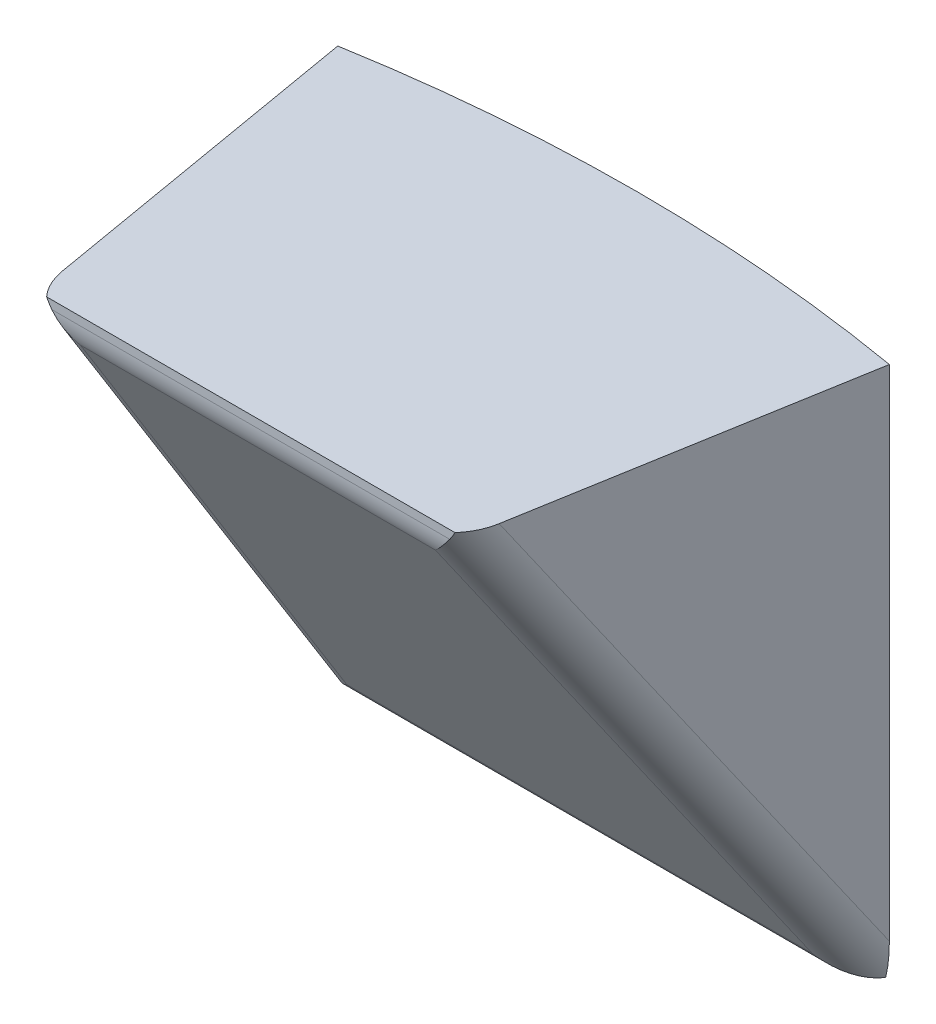
ISO-10303-21;
HEADER;
FILE_DESCRIPTION(('STEP AP214'),'2;1');
FILE_NAME('part.step','',(''),(''),'','','');
FILE_SCHEMA(('AUTOMOTIVE_DESIGN { 1 0 10303 214 1 1 1 1 }'));
ENDSEC;
DATA;
#1=APPLICATION_CONTEXT('core data for automotive mechanical design processes');
#2=APPLICATION_PROTOCOL_DEFINITION('international standard','automotive_design',2000,#1);
#3=PRODUCT_CONTEXT('',#1,'mechanical');
#4=PRODUCT('Part','Part','',(#3));
#5=PRODUCT_RELATED_PRODUCT_CATEGORY('part','',(#4));
#6=PRODUCT_DEFINITION_FORMATION('','',#4);
#7=PRODUCT_DEFINITION_CONTEXT('part definition',#1,'design');
#8=PRODUCT_DEFINITION('design','',#6,#7);
#9=PRODUCT_DEFINITION_SHAPE('','',#8);
#10=(LENGTH_UNIT() NAMED_UNIT(*) SI_UNIT(.MILLI.,.METRE.));
#11=(NAMED_UNIT(*) PLANE_ANGLE_UNIT() SI_UNIT($,.RADIAN.));
#12=(NAMED_UNIT(*) SI_UNIT($,.STERADIAN.) SOLID_ANGLE_UNIT());
#13=UNCERTAINTY_MEASURE_WITH_UNIT(LENGTH_MEASURE(1.E-05),#10,'distance_accuracy_value','');
#14=(GEOMETRIC_REPRESENTATION_CONTEXT(3) GLOBAL_UNCERTAINTY_ASSIGNED_CONTEXT((#13)) GLOBAL_UNIT_ASSIGNED_CONTEXT((#10,
#11,#12)) REPRESENTATION_CONTEXT('',''));
#15=CARTESIAN_POINT('',(0.,0.,0.));
#16=DIRECTION('',(0.,0.,1.));
#17=DIRECTION('',(1.,0.,0.));
#18=AXIS2_PLACEMENT_3D('',#15,#16,#17);
#19=CARTESIAN_POINT('',(-12.7,31.75,-73.8463201327698));
#20=DIRECTION('',(0.985526486983062,0.,-0.16952151325075));
#21=DIRECTION('',(-0.16952151325075,0.,-0.985526486983062));
#22=AXIS2_PLACEMENT_3D('',#19,#20,#21);
#23=PLANE('',#22);
#24=DIRECTION('',(0.,-1.,0.));
#25=VECTOR('',#24,1.);
#26=CARTESIAN_POINT('',(-16.4137200465182,31.75,-95.4363201327698));
#27=LINE('',#26,#25);
#28=CARTESIAN_POINT('',(-16.4137200465182,31.75,-95.4363201327698));
#29=VERTEX_POINT('',#28);
#30=CARTESIAN_POINT('',(-16.4137200465182,2.02817315435391,-95.4363201327698));
#31=VERTEX_POINT('',#30);
#32=EDGE_CURVE('E134',#29,#31,#27,.T.);
#33=ORIENTED_EDGE('',*,*,#32,.T.);
#34=DIRECTION('',(0.0949832196734159,0.828288489868125,0.55219232657875));
#35=VECTOR('',#34,1.);
#36=CARTESIAN_POINT('',(-12.9095211733622,32.5860717265832,-75.0643877512836));
#37=LINE('',#36,#35);
#38=CARTESIAN_POINT('',(-13.0053969285371,31.75,-75.6217689023391));
#39=VERTEX_POINT('',#38);
#40=EDGE_CURVE('E50',#31,#39,#37,.T.);
#41=ORIENTED_EDGE('',*,*,#40,.T.);
#42=DIRECTION('',(0.16952151325075,0.,0.985526486983062));
#43=VECTOR('',#42,1.);
#44=CARTESIAN_POINT('',(-12.7,31.75,-73.8463201327698));
#45=LINE('',#44,#43);
#46=EDGE_CURVE('E146',#29,#39,#45,.T.);
#47=ORIENTED_EDGE('',*,*,#46,.F.);
#48=EDGE_LOOP('',(#33,#41,#47));
#49=FACE_BOUND('',#48,.T.);
#50=ADVANCED_FACE('F39',(#49),#23,.F.);
#51=CARTESIAN_POINT('',(-12.7,31.75,-73.8463201327698));
#52=DIRECTION('',(0.,0.,-1.));
#53=DIRECTION('',(-1.,0.,0.));
#54=AXIS2_PLACEMENT_3D('',#51,#52,#53);
#55=PLANE('',#54);
#56=DIRECTION('',(1.,0.,0.));
#57=VECTOR('',#56,1.);
#58=CARTESIAN_POINT('',(-12.7,31.2490501198393,-73.8463201327698));
#59=LINE('',#58,#57);
#60=CARTESIAN_POINT('',(-11.8405097304884,31.2490501198393,-73.8463201327698));
#61=VERTEX_POINT('',#60);
#62=CARTESIAN_POINT('',(11.8405097304884,31.2490501198393,-73.8463201327698));
#63=VERTEX_POINT('',#62);
#64=EDGE_CURVE('E65',#61,#63,#59,.T.);
#65=ORIENTED_EDGE('',*,*,#64,.T.);
#66=CARTESIAN_POINT('',(10.1226973769365,35.0590501198393,-73.8463201327698));
#67=DIRECTION('',(0.,0.,-1.));
#68=DIRECTION('',(0.113927444341676,-0.993489072625248,0.));
#69=AXIS2_PLACEMENT_3D('',#66,#67,#68);
#70=ELLIPSE('',#69,4.59984660731746,2.54);
#71=CARTESIAN_POINT('',(12.1490599067134,31.75,-73.8463201327698));
#72=VERTEX_POINT('',#71);
#73=EDGE_CURVE('E210',#63,#72,#70,.F.);
#74=ORIENTED_EDGE('',*,*,#73,.T.);
#75=DIRECTION('',(1.,0.,0.));
#76=VECTOR('',#75,1.);
#77=CARTESIAN_POINT('',(-12.7,31.75,-73.8463201327698));
#78=LINE('',#77,#76);
#79=CARTESIAN_POINT('',(-12.1490599067134,31.75,-73.8463201327698));
#80=VERTEX_POINT('',#79);
#81=EDGE_CURVE('E126',#80,#72,#78,.T.);
#82=ORIENTED_EDGE('',*,*,#81,.F.);
#83=CARTESIAN_POINT('',(-10.1226973769365,35.0590501198393,-73.8463201327698));
#84=DIRECTION('',(0.,0.,-1.));
#85=DIRECTION('',(0.113927444341676,0.993489072625247,0.));
#86=AXIS2_PLACEMENT_3D('',#83,#84,#85);
#87=ELLIPSE('',#86,4.59984660731746,2.54);
#88=EDGE_CURVE('E207',#80,#61,#87,.F.);
#89=ORIENTED_EDGE('',*,*,#88,.T.);
#90=EDGE_LOOP('',(#65,#74,#82,#89));
#91=FACE_BOUND('',#90,.T.);
#92=ADVANCED_FACE('F262',(#91),#55,.F.);
#93=CARTESIAN_POINT('',(12.7,31.75,-73.8463201327698));
#94=DIRECTION('',(-0.985526486983062,0.,-0.169521513250749));
#95=DIRECTION('',(-0.169521513250749,0.,0.985526486983062));
#96=AXIS2_PLACEMENT_3D('',#93,#94,#95);
#97=PLANE('',#96);
#98=DIRECTION('',(0.169521513250749,0.,-0.985526486983062));
#99=VECTOR('',#98,1.);
#100=CARTESIAN_POINT('',(12.7,31.75,-73.8463201327698));
#101=LINE('',#100,#99);
#102=CARTESIAN_POINT('',(13.0053969285371,31.75,-75.6217689023391));
#103=VERTEX_POINT('',#102);
#104=CARTESIAN_POINT('',(16.4137200465182,31.75,-95.4363201327698));
#105=VERTEX_POINT('',#104);
#106=EDGE_CURVE('E113',#103,#105,#101,.T.);
#107=ORIENTED_EDGE('',*,*,#106,.F.);
#108=DIRECTION('',(0.0949832196734155,-0.828288489868125,-0.55219232657875));
#109=VECTOR('',#108,1.);
#110=CARTESIAN_POINT('',(12.9095211733622,32.5860717265832,-75.0643877512836));
#111=LINE('',#110,#109);
#112=CARTESIAN_POINT('',(16.4137200465182,2.02817315435392,-95.4363201327698));
#113=VERTEX_POINT('',#112);
#114=EDGE_CURVE('E131',#103,#113,#111,.T.);
#115=ORIENTED_EDGE('',*,*,#114,.T.);
#116=DIRECTION('',(0.,-1.,0.));
#117=VECTOR('',#116,1.);
#118=CARTESIAN_POINT('',(16.4137200465182,31.75,-95.4363201327698));
#119=LINE('',#118,#117);
#120=EDGE_CURVE('E129',#105,#113,#119,.T.);
#121=ORIENTED_EDGE('',*,*,#120,.F.);
#122=EDGE_LOOP('',(#107,#115,#121));
#123=FACE_BOUND('',#122,.T.);
#124=ADVANCED_FACE('F130',(#123),#97,.F.);
#125=CARTESIAN_POINT('',(0.,31.75,0.));
#126=DIRECTION('',(0.,-1.,0.));
#127=DIRECTION('',(0.,0.,-1.));
#128=AXIS2_PLACEMENT_3D('',#125,#126,#127);
#129=CYLINDRICAL_SURFACE('',#128,96.8375);
#130=CARTESIAN_POINT('',(-15.8853565424994,0.,-95.5256868793293));
#131=CARTESIAN_POINT('',(-15.9293247019239,-5.30976486019576E-07,-95.518375234398));
#132=CARTESIAN_POINT('',(-15.9732877254308,3.13031430708792E-05,-95.5110332481291));
#133=CARTESIAN_POINT('',(-16.061203500609,0.000159701574270502,-95.4962885929165));
#134=CARTESIAN_POINT('',(-16.1051562522804,0.000256265885913214,-95.4888859239726));
#135=CARTESIAN_POINT('',(-16.149103868034,0.000385195293598833,-95.4814529136913));
#136=B_SPLINE_CURVE_WITH_KNOTS('',3,(#130,#131,#132,#133,#134,#135),.UNSPECIFIED.,.F.,.F.,(4,2,
4),(0.,0.133715664395814,0.267431328791604),.UNSPECIFIED.);
#137=CARTESIAN_POINT('',(-15.8853565424994,0.,-95.5256868793293));
#138=VERTEX_POINT('',#137);
#139=CARTESIAN_POINT('',(-16.149103868034,0.000385195293598833,-95.4814529136913));
#140=VERTEX_POINT('',#139);
#141=EDGE_CURVE('E179',#138,#140,#136,.T.);
#142=ORIENTED_EDGE('',*,*,#141,.T.);
#143=CARTESIAN_POINT('',(-16.149103868034,0.000385195293596172,-95.4814529136911));
#144=CARTESIAN_POINT('',(-16.171933976302,0.0829069312364557,-95.4775913959373));
#145=CARTESIAN_POINT('',(-16.1931478382836,0.165875060018588,-95.4739952018541));
#146=CARTESIAN_POINT('',(-16.2324701708106,0.332552989709144,-95.4673175665721));
#147=CARTESIAN_POINT('',(-16.2505790849718,0.416262682867112,-95.4642360518408));
#148=CARTESIAN_POINT('',(-16.3002929933888,0.667529302727803,-95.4557645792868));
#149=CARTESIAN_POINT('',(-16.3274955551877,0.835996152764147,-95.4511120007597));
#150=CARTESIAN_POINT('',(-16.3707857121779,1.17435236915795,-95.4436968002256));
#151=CARTESIAN_POINT('',(-16.3868747310715,1.34424155048418,-95.4409339361369));
#152=CARTESIAN_POINT('',(-16.4029797826186,1.59996300795439,-95.4381668180346));
#153=CARTESIAN_POINT('',(-16.4070100021143,1.68555274984234,-95.4374739803222));
#154=CARTESIAN_POINT('',(-16.412378941859,1.85681767610045,-95.436550796089));
#155=CARTESIAN_POINT('',(-16.4137177103842,1.94249285891049,-95.4363204412726));
#156=CARTESIAN_POINT('',(-16.4137200465182,2.02817315435391,-95.4363201327698));
#157=B_SPLINE_CURVE_WITH_KNOTS('',3,(#143,#144,#145,#146,#147,#148,#149,#150,#151,#152,#153,
#154,#155,#156),.UNSPECIFIED.,.F.,.F.,(4,2,2,2,2,2,4),(0.,0.257087233597104,0.514137705491005,
1.02584055142907,1.53747783342796,1.79450207629623,2.05152170891185),.UNSPECIFIED.);
#158=EDGE_CURVE('E185',#140,#31,#157,.T.);
#159=ORIENTED_EDGE('',*,*,#158,.T.);
#160=ORIENTED_EDGE('',*,*,#32,.F.);
#161=CARTESIAN_POINT('',(0.,31.75,0.));
#162=DIRECTION('',(0.,1.,0.));
#163=DIRECTION('',(0.,0.,1.));
#164=AXIS2_PLACEMENT_3D('',#161,#162,#163);
#165=CIRCLE('',#164,96.8375);
#166=EDGE_CURVE('E118',#105,#29,#165,.T.);
#167=ORIENTED_EDGE('',*,*,#166,.F.);
#168=ORIENTED_EDGE('',*,*,#120,.T.);
#169=CARTESIAN_POINT('',(16.4137200465182,2.02817315435392,-95.4363201327698));
#170=CARTESIAN_POINT('',(16.4137177103842,1.9424928589105,-95.4363204412726));
#171=CARTESIAN_POINT('',(16.412378941859,1.85681767610046,-95.436550796089));
#172=CARTESIAN_POINT('',(16.4070100021143,1.68555274984235,-95.4374739803222));
#173=CARTESIAN_POINT('',(16.4029797826186,1.5999630079544,-95.4381668180346));
#174=CARTESIAN_POINT('',(16.3868747310715,1.3442415504842,-95.4409339361369));
#175=CARTESIAN_POINT('',(16.3707857121779,1.17435236915796,-95.4436968002256));
#176=CARTESIAN_POINT('',(16.3274955551877,0.835996152764155,-95.4511120007597));
#177=CARTESIAN_POINT('',(16.3002929933888,0.66752930272781,-95.4557645792868));
#178=CARTESIAN_POINT('',(16.2505790849718,0.416262682867121,-95.4642360518408));
#179=CARTESIAN_POINT('',(16.2324701708106,0.332552989709155,-95.4673175665721));
#180=CARTESIAN_POINT('',(16.1931478382836,0.165875060018597,-95.4739952018541));
#181=CARTESIAN_POINT('',(16.171933976302,0.0829069312364613,-95.4775913959374));
#182=CARTESIAN_POINT('',(16.1491038680341,0.00038519529359121,-95.4814529136913));
#183=B_SPLINE_CURVE_WITH_KNOTS('',3,(#169,#170,#171,#172,#173,#174,#175,#176,#177,#178,#179,
#180,#181,#182),.UNSPECIFIED.,.F.,.F.,(4,2,2,2,2,2,4),(0.,0.257019632615621,0.514043875483893,
1.02568115748278,1.53738400342085,1.79443447531475,2.05152170891185),.UNSPECIFIED.);
#184=CARTESIAN_POINT('',(16.1491038680342,0.000385195293591076,-95.4814529136915));
#185=VERTEX_POINT('',#184);
#186=EDGE_CURVE('E159',#113,#185,#183,.T.);
#187=ORIENTED_EDGE('',*,*,#186,.T.);
#188=CARTESIAN_POINT('',(16.1491038680342,0.000385195293591076,-95.4814529136915));
#189=CARTESIAN_POINT('',(16.1051562522805,0.000256265885909297,-95.4888859239727));
#190=CARTESIAN_POINT('',(16.0612035006091,0.000159701574269132,-95.4962885929165));
#191=CARTESIAN_POINT('',(15.9732877254308,3.13031430720236E-05,-95.5110332481291));
#192=CARTESIAN_POINT('',(15.9293247019239,-5.3097648490922E-07,-95.5183752343979));
#193=CARTESIAN_POINT('',(15.8853565424994,0.,-95.5256868793293));
#194=B_SPLINE_CURVE_WITH_KNOTS('',3,(#188,#189,#190,#191,#192,#193),.UNSPECIFIED.,.F.,.F.,(4,2,
4),(0.,0.133715664395864,0.267431328791752),.UNSPECIFIED.);
#195=CARTESIAN_POINT('',(15.8853565424994,0.,-95.5256868793293));
#196=VERTEX_POINT('',#195);
#197=EDGE_CURVE('E150',#185,#196,#194,.T.);
#198=ORIENTED_EDGE('',*,*,#197,.T.);
#199=CARTESIAN_POINT('',(0.,0.,0.));
#200=DIRECTION('',(0.,1.,0.));
#201=DIRECTION('',(0.,0.,1.));
#202=AXIS2_PLACEMENT_3D('',#199,#200,#201);
#203=CIRCLE('',#202,96.8375);
#204=EDGE_CURVE('E143',#196,#138,#203,.T.);
#205=ORIENTED_EDGE('',*,*,#204,.T.);
#206=EDGE_LOOP('',(#142,#159,#160,#167,#168,#187,#198,#205));
#207=FACE_BOUND('',#206,.T.);
#208=ADVANCED_FACE('F136',(#207),#129,.T.);
#209=CARTESIAN_POINT('',(0.,31.75,0.));
#210=DIRECTION('',(0.,1.,0.));
#211=DIRECTION('',(0.,0.,1.));
#212=AXIS2_PLACEMENT_3D('',#209,#210,#211);
#213=PLANE('',#212);
#214=ORIENTED_EDGE('',*,*,#81,.T.);
#215=CARTESIAN_POINT('',(10.5021596516001,31.75,-76.052353545996));
#216=DIRECTION('',(0.,1.,0.));
#217=DIRECTION('',(0.169521513250749,0.,-0.985526486983062));
#218=AXIS2_PLACEMENT_3D('',#215,#216,#217);
#219=ELLIPSE('',#218,3.06656440487831,2.54);
#220=EDGE_CURVE('E121',#72,#103,#219,.T.);
#221=ORIENTED_EDGE('',*,*,#220,.T.);
#222=ORIENTED_EDGE('',*,*,#106,.T.);
#223=ORIENTED_EDGE('',*,*,#166,.T.);
#224=ORIENTED_EDGE('',*,*,#46,.T.);
#225=CARTESIAN_POINT('',(-10.5021596516001,31.75,-76.052353545996));
#226=DIRECTION('',(0.,1.,0.));
#227=DIRECTION('',(0.16952151325075,0.,0.985526486983062));
#228=AXIS2_PLACEMENT_3D('',#225,#226,#227);
#229=ELLIPSE('',#228,3.06656440487831,2.54);
#230=EDGE_CURVE('E213',#39,#80,#229,.T.);
#231=ORIENTED_EDGE('',*,*,#230,.T.);
#232=EDGE_LOOP('',(#214,#221,#222,#223,#224,#231));
#233=FACE_BOUND('',#232,.T.);
#234=ADVANCED_FACE('F116',(#233),#213,.T.);
#235=CARTESIAN_POINT('',(0.,0.,0.));
#236=DIRECTION('',(0.,1.,0.));
#237=DIRECTION('',(0.,0.,1.));
#238=AXIS2_PLACEMENT_3D('',#235,#236,#237);
#239=PLANE('',#238);
#240=ORIENTED_EDGE('',*,*,#204,.F.);
#241=DIRECTION('',(-1.,0.,0.));
#242=VECTOR('',#241,1.);
#243=CARTESIAN_POINT('',(0.,0.,-95.5256868793293));
#244=LINE('',#243,#242);
#245=EDGE_CURVE('E11',#196,#138,#244,.T.);
#246=ORIENTED_EDGE('',*,*,#245,.T.);
#247=EDGE_LOOP('',(#240,#246));
#248=FACE_BOUND('',#247,.T.);
#249=ADVANCED_FACE('F172',(#248),#239,.F.);
#250=CARTESIAN_POINT('',(-16.4137200465182,30.48,-73.8463201327698));
#251=DIRECTION('',(0.,0.554700196225229,-0.832050294337844));
#252=DIRECTION('',(0.,0.832050294337844,0.554700196225229));
#253=AXIS2_PLACEMENT_3D('',#250,#251,#252);
#254=PLANE('',#253);
#255=DIRECTION('',(0.0949832196734158,0.828288489868125,0.55219232657875));
#256=VECTOR('',#255,1.);
#257=CARTESIAN_POINT('',(-10.5397037352124,30.0136633314097,-74.1572112451633));
#258=LINE('',#257,#256);
#259=CARTESIAN_POINT('',(-10.5596056177033,29.8401116214272,-74.2729123851517));
#260=VERTEX_POINT('',#259);
#261=CARTESIAN_POINT('',(-13.8517894974793,1.13106150158792,-93.4122791317112));
#262=VERTEX_POINT('',#261);
#263=EDGE_CURVE('E195',#260,#262,#258,.F.);
#264=ORIENTED_EDGE('',*,*,#263,.T.);
#265=DIRECTION('',(-1.,0.,0.));
#266=VECTOR('',#265,1.);
#267=CARTESIAN_POINT('',(-16.4137200465182,1.13106150158792,-93.4122791317112));
#268=LINE('',#267,#266);
#269=CARTESIAN_POINT('',(13.8517894974793,1.13106150158792,-93.4122791317112));
#270=VERTEX_POINT('',#269);
#271=EDGE_CURVE('E202',#262,#270,#268,.F.);
#272=ORIENTED_EDGE('',*,*,#271,.T.);
#273=DIRECTION('',(0.0949832196734154,-0.828288489868125,-0.55219232657875));
#274=VECTOR('',#273,1.);
#275=CARTESIAN_POINT('',(10.2435407416107,32.5963131886017,-72.435444673702));
#276=LINE('',#275,#274);
#277=CARTESIAN_POINT('',(10.5596056177034,29.8401116214272,-74.2729123851517));
#278=VERTEX_POINT('',#277);
#279=EDGE_CURVE('E198',#270,#278,#276,.F.);
#280=ORIENTED_EDGE('',*,*,#279,.T.);
#281=DIRECTION('',(1.,0.,0.));
#282=VECTOR('',#281,1.);
#283=CARTESIAN_POINT('',(-16.4137200465182,29.8401116214272,-74.2729123851517));
#284=LINE('',#283,#282);
#285=EDGE_CURVE('E192',#278,#260,#284,.F.);
#286=ORIENTED_EDGE('',*,*,#285,.T.);
#287=EDGE_LOOP('',(#264,#272,#280,#286));
#288=FACE_BOUND('',#287,.T.);
#289=ADVANCED_FACE('F245',(#288),#254,.F.);
#290=CARTESIAN_POINT('',(-10.4062838964252,32.5860717265832,-75.4949723949405));
#291=DIRECTION('',(0.0949832196734159,0.828288489868125,0.55219232657875));
#292=DIRECTION('',(0.,-0.554700196225229,0.832050294337844));
#293=AXIS2_PLACEMENT_3D('',#290,#291,#292);
#294=CYLINDRICAL_SURFACE('',#293,2.54);
#295=CARTESIAN_POINT('',(-13.8517894974793,2.54,-95.5256868793293));
#296=DIRECTION('',(-0.672687438684038,0.615656278262372,0.410437518841581));
#297=DIRECTION('',(-0.739926759778769,-0.559709781354425,-0.373139854236283));
#298=AXIS2_PLACEMENT_3D('',#295,#296,#297);
#299=ELLIPSE('',#298,3.77589925711849,2.54);
#300=EDGE_CURVE('E226',#262,#140,#299,.F.);
#301=ORIENTED_EDGE('',*,*,#300,.F.);
#302=ORIENTED_EDGE('',*,*,#263,.F.);
#303=CARTESIAN_POINT('',(-10.5596056177033,31.2490501198393,-76.3863201327698));
#304=DIRECTION('',(0.739926759778769,0.559709781354425,0.373139854236283));
#305=DIRECTION('',(0.672687438684038,-0.615656278262372,-0.410437518841581));
#306=AXIS2_PLACEMENT_3D('',#303,#304,#305);
#307=ELLIPSE('',#306,3.4327721851274,2.54);
#308=EDGE_CURVE('E44',#61,#260,#307,.T.);
#309=ORIENTED_EDGE('',*,*,#308,.F.);
#310=ORIENTED_EDGE('',*,*,#88,.F.);
#311=ORIENTED_EDGE('',*,*,#230,.F.);
#312=ORIENTED_EDGE('',*,*,#40,.F.);
#313=ORIENTED_EDGE('',*,*,#158,.F.);
#314=EDGE_LOOP('',(#301,#302,#309,#310,#311,#312,#313));
#315=FACE_BOUND('',#314,.T.);
#316=ADVANCED_FACE('F41',(#315),#294,.T.);
#317=CARTESIAN_POINT('',(-12.7,31.2490501198393,-76.3863201327698));
#318=DIRECTION('',(1.,0.,0.));
#319=DIRECTION('',(0.,0.,-1.));
#320=AXIS2_PLACEMENT_3D('',#317,#318,#319);
#321=CYLINDRICAL_SURFACE('',#320,2.54);
#322=ORIENTED_EDGE('',*,*,#308,.T.);
#323=ORIENTED_EDGE('',*,*,#285,.F.);
#324=CARTESIAN_POINT('',(10.5596056177034,31.2490501198393,-76.3863201327698));
#325=DIRECTION('',(0.739926759778769,-0.559709781354425,-0.373139854236283));
#326=DIRECTION('',(0.672687438684039,0.615656278262371,0.410437518841581));
#327=AXIS2_PLACEMENT_3D('',#324,#325,#326);
#328=ELLIPSE('',#327,3.4327721851274,2.54);
#329=EDGE_CURVE('E224',#63,#278,#328,.T.);
#330=ORIENTED_EDGE('',*,*,#329,.F.);
#331=ORIENTED_EDGE('',*,*,#64,.F.);
#332=EDGE_LOOP('',(#322,#323,#330,#331));
#333=FACE_BOUND('',#332,.T.);
#334=ADVANCED_FACE('F238',(#333),#321,.T.);
#335=CARTESIAN_POINT('',(0.,2.54,-95.5256868793293));
#336=DIRECTION('',(-1.,0.,0.));
#337=DIRECTION('',(0.,0.,1.));
#338=AXIS2_PLACEMENT_3D('',#335,#336,#337);
#339=CYLINDRICAL_SURFACE('',#338,2.54);
#340=ORIENTED_EDGE('',*,*,#245,.F.);
#341=ORIENTED_EDGE('',*,*,#197,.F.);
#342=CARTESIAN_POINT('',(13.8517894974793,2.54,-95.5256868793293));
#343=DIRECTION('',(-0.672687438684039,-0.615656278262371,-0.410437518841581));
#344=DIRECTION('',(-0.739926759778769,0.559709781354425,0.373139854236283));
#345=AXIS2_PLACEMENT_3D('',#342,#343,#344);
#346=ELLIPSE('',#345,3.77589925711849,2.54);
#347=EDGE_CURVE('E220',#270,#185,#346,.F.);
#348=ORIENTED_EDGE('',*,*,#347,.F.);
#349=ORIENTED_EDGE('',*,*,#271,.F.);
#350=ORIENTED_EDGE('',*,*,#300,.T.);
#351=ORIENTED_EDGE('',*,*,#141,.F.);
#352=EDGE_LOOP('',(#340,#341,#348,#349,#350,#351));
#353=FACE_BOUND('',#352,.T.);
#354=ADVANCED_FACE('F166',(#353),#339,.T.);
#355=CARTESIAN_POINT('',(10.4062838964252,32.5860717265832,-75.4949723949405));
#356=DIRECTION('',(0.0949832196734155,-0.828288489868125,-0.55219232657875));
#357=DIRECTION('',(0.,0.554700196225229,-0.832050294337844));
#358=AXIS2_PLACEMENT_3D('',#355,#356,#357);
#359=CYLINDRICAL_SURFACE('',#358,2.54);
#360=ORIENTED_EDGE('',*,*,#329,.T.);
#361=ORIENTED_EDGE('',*,*,#279,.F.);
#362=ORIENTED_EDGE('',*,*,#347,.T.);
#363=ORIENTED_EDGE('',*,*,#186,.F.);
#364=ORIENTED_EDGE('',*,*,#114,.F.);
#365=ORIENTED_EDGE('',*,*,#220,.F.);
#366=ORIENTED_EDGE('',*,*,#73,.F.);
#367=EDGE_LOOP('',(#360,#361,#362,#363,#364,#365,#366));
#368=FACE_BOUND('',#367,.T.);
#369=ADVANCED_FACE('F249',(#368),#359,.T.);
#370=CLOSED_SHELL('',(#50,#92,#124,#208,#234,#249,#289,#316,#334,#354,#369));
#371=MANIFOLD_SOLID_BREP('B2',#370);
#372=ADVANCED_BREP_SHAPE_REPRESENTATION('',(#18,#371),#14);
#373=SHAPE_DEFINITION_REPRESENTATION(#9,#372);
ENDSEC;
END-ISO-10303-21;
